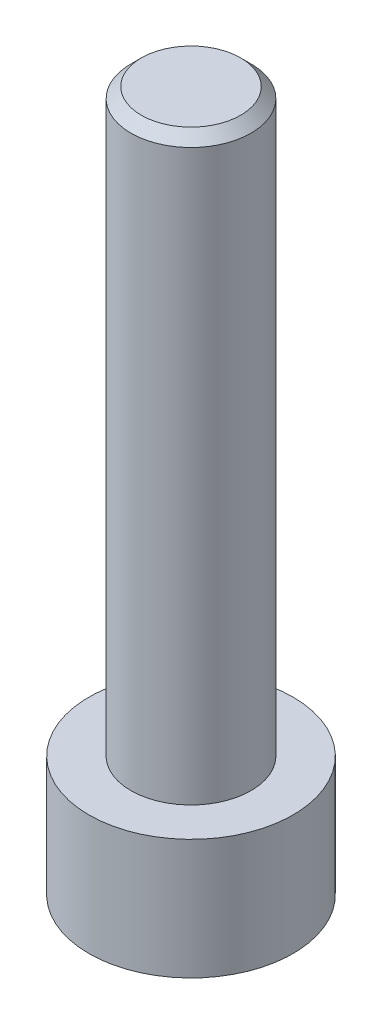
ISO-10303-21;
HEADER;
FILE_DESCRIPTION(('STEP AP214'),'2;1');
FILE_NAME('part.step','',(''),(''),'','','');
FILE_SCHEMA(('AUTOMOTIVE_DESIGN { 1 0 10303 214 1 1 1 1 }'));
ENDSEC;
DATA;
#1=APPLICATION_CONTEXT('core data for automotive mechanical design processes');
#2=APPLICATION_PROTOCOL_DEFINITION('international standard','automotive_design',2000,#1);
#3=PRODUCT_CONTEXT('',#1,'mechanical');
#4=PRODUCT('Part','Part','',(#3));
#5=PRODUCT_RELATED_PRODUCT_CATEGORY('part','',(#4));
#6=PRODUCT_DEFINITION_FORMATION('','',#4);
#7=PRODUCT_DEFINITION_CONTEXT('part definition',#1,'design');
#8=PRODUCT_DEFINITION('design','',#6,#7);
#9=PRODUCT_DEFINITION_SHAPE('','',#8);
#10=(LENGTH_UNIT() NAMED_UNIT(*) SI_UNIT(.MILLI.,.METRE.));
#11=(NAMED_UNIT(*) PLANE_ANGLE_UNIT() SI_UNIT($,.RADIAN.));
#12=(NAMED_UNIT(*) SI_UNIT($,.STERADIAN.) SOLID_ANGLE_UNIT());
#13=UNCERTAINTY_MEASURE_WITH_UNIT(LENGTH_MEASURE(1.E-05),#10,'distance_accuracy_value','');
#14=(GEOMETRIC_REPRESENTATION_CONTEXT(3) GLOBAL_UNCERTAINTY_ASSIGNED_CONTEXT((#13)) GLOBAL_UNIT_ASSIGNED_CONTEXT((#10,
#11,#12)) REPRESENTATION_CONTEXT('',''));
#15=CARTESIAN_POINT('',(0.,0.,0.));
#16=DIRECTION('',(0.,0.,1.));
#17=DIRECTION('',(1.,0.,0.));
#18=AXIS2_PLACEMENT_3D('',#15,#16,#17);
#19=CARTESIAN_POINT('',(0.,2.9,0.));
#20=DIRECTION('',(0.,-1.,0.));
#21=DIRECTION('',(0.,0.,-1.));
#22=AXIS2_PLACEMENT_3D('',#19,#20,#21);
#23=CYLINDRICAL_SURFACE('',#22,2.465);
#24=CARTESIAN_POINT('',(0.,2.9,0.));
#25=DIRECTION('',(0.,1.,0.));
#26=DIRECTION('',(0.,0.,1.));
#27=AXIS2_PLACEMENT_3D('',#24,#25,#26);
#28=CIRCLE('',#27,2.465);
#29=CARTESIAN_POINT('',(0.,2.9,2.465));
#30=VERTEX_POINT('',#29);
#31=EDGE_CURVE('E177',#30,#30,#28,.T.);
#32=ORIENTED_EDGE('',*,*,#31,.F.);
#33=EDGE_LOOP('',(#32));
#34=FACE_BOUND('',#33,.T.);
#35=CARTESIAN_POINT('',(0.,0.,0.));
#36=DIRECTION('',(0.,1.,0.));
#37=DIRECTION('',(0.,0.,1.));
#38=AXIS2_PLACEMENT_3D('',#35,#36,#37);
#39=CIRCLE('',#38,2.465);
#40=CARTESIAN_POINT('',(0.,0.,2.465));
#41=VERTEX_POINT('',#40);
#42=EDGE_CURVE('E163',#41,#41,#39,.T.);
#43=ORIENTED_EDGE('',*,*,#42,.T.);
#44=EDGE_LOOP('',(#43));
#45=FACE_BOUND('',#44,.T.);
#46=ADVANCED_FACE('F47',(#34,#45),#23,.T.);
#47=CARTESIAN_POINT('',(0.,2.9,0.));
#48=DIRECTION('',(0.,1.,0.));
#49=DIRECTION('',(0.,0.,1.));
#50=AXIS2_PLACEMENT_3D('',#47,#48,#49);
#51=PLANE('',#50);
#52=CARTESIAN_POINT('',(0.,2.9,0.));
#53=DIRECTION('',(0.,1.,0.));
#54=DIRECTION('',(0.,0.,1.));
#55=AXIS2_PLACEMENT_3D('',#52,#53,#54);
#56=CIRCLE('',#55,1.45);
#57=CARTESIAN_POINT('',(0.,2.9,1.45));
#58=VERTEX_POINT('',#57);
#59=EDGE_CURVE('E173',#58,#58,#56,.T.);
#60=ORIENTED_EDGE('',*,*,#59,.F.);
#61=EDGE_LOOP('',(#60));
#62=FACE_BOUND('',#61,.T.);
#63=ORIENTED_EDGE('',*,*,#31,.T.);
#64=EDGE_LOOP('',(#63));
#65=FACE_BOUND('',#64,.T.);
#66=ADVANCED_FACE('F199',(#62,#65),#51,.T.);
#67=CARTESIAN_POINT('',(0.,0.,0.));
#68=DIRECTION('',(0.,1.,0.));
#69=DIRECTION('',(0.,0.,1.));
#70=AXIS2_PLACEMENT_3D('',#67,#68,#69);
#71=PLANE('',#70);
#72=DIRECTION('',(0.5,0.,0.866025403784439));
#73=VECTOR('',#72,1.);
#74=CARTESIAN_POINT('',(0.733234841870825,0.,-1.27));
#75=LINE('',#74,#73);
#76=CARTESIAN_POINT('',(0.733234841870825,0.,-1.27));
#77=VERTEX_POINT('',#76);
#78=CARTESIAN_POINT('',(1.46646968374165,0.,0.));
#79=VERTEX_POINT('',#78);
#80=EDGE_CURVE('E144',#77,#79,#75,.T.);
#81=ORIENTED_EDGE('',*,*,#80,.F.);
#82=DIRECTION('',(1.,0.,0.));
#83=VECTOR('',#82,1.);
#84=CARTESIAN_POINT('',(-0.733234841870825,0.,-1.27));
#85=LINE('',#84,#83);
#86=CARTESIAN_POINT('',(-0.733234841870825,0.,-1.27));
#87=VERTEX_POINT('',#86);
#88=EDGE_CURVE('E64',#87,#77,#85,.T.);
#89=ORIENTED_EDGE('',*,*,#88,.F.);
#90=DIRECTION('',(0.5,0.,-0.866025403784438));
#91=VECTOR('',#90,1.);
#92=CARTESIAN_POINT('',(-1.46646968374165,0.,0.));
#93=LINE('',#92,#91);
#94=CARTESIAN_POINT('',(-1.46646968374165,0.,0.));
#95=VERTEX_POINT('',#94);
#96=EDGE_CURVE('E157',#95,#87,#93,.T.);
#97=ORIENTED_EDGE('',*,*,#96,.F.);
#98=DIRECTION('',(-0.5,0.,-0.866025403784439));
#99=VECTOR('',#98,1.);
#100=CARTESIAN_POINT('',(-0.733234841870825,0.,1.27));
#101=LINE('',#100,#99);
#102=CARTESIAN_POINT('',(-0.733234841870825,0.,1.27));
#103=VERTEX_POINT('',#102);
#104=EDGE_CURVE('E154',#103,#95,#101,.T.);
#105=ORIENTED_EDGE('',*,*,#104,.F.);
#106=DIRECTION('',(-1.,0.,0.));
#107=VECTOR('',#106,1.);
#108=CARTESIAN_POINT('',(0.733234841870825,0.,1.27));
#109=LINE('',#108,#107);
#110=CARTESIAN_POINT('',(0.733234841870825,0.,1.27));
#111=VERTEX_POINT('',#110);
#112=EDGE_CURVE('E112',#111,#103,#109,.T.);
#113=ORIENTED_EDGE('',*,*,#112,.F.);
#114=DIRECTION('',(-0.5,0.,0.866025403784439));
#115=VECTOR('',#114,1.);
#116=CARTESIAN_POINT('',(1.46646968374165,0.,0.));
#117=LINE('',#116,#115);
#118=EDGE_CURVE('E148',#79,#111,#117,.T.);
#119=ORIENTED_EDGE('',*,*,#118,.F.);
#120=EDGE_LOOP('',(#81,#89,#97,#105,#113,#119));
#121=FACE_BOUND('',#120,.T.);
#122=ORIENTED_EDGE('',*,*,#42,.F.);
#123=EDGE_LOOP('',(#122));
#124=FACE_BOUND('',#123,.T.);
#125=ADVANCED_FACE('F204',(#121,#124),#71,.F.);
#126=CARTESIAN_POINT('',(0.,16.9,0.));
#127=DIRECTION('',(0.,-1.,0.));
#128=DIRECTION('',(0.,0.,-1.));
#129=AXIS2_PLACEMENT_3D('',#126,#127,#128);
#130=CYLINDRICAL_SURFACE('',#129,1.45);
#131=CARTESIAN_POINT('',(0.,16.65,0.));
#132=DIRECTION('',(0.,1.,0.));
#133=DIRECTION('',(0.,0.,1.));
#134=AXIS2_PLACEMENT_3D('',#131,#132,#133);
#135=CIRCLE('',#134,1.45);
#136=CARTESIAN_POINT('',(0.,16.65,1.45));
#137=VERTEX_POINT('',#136);
#138=EDGE_CURVE('E11',#137,#137,#135,.F.);
#139=ORIENTED_EDGE('',*,*,#138,.T.);
#140=EDGE_LOOP('',(#139));
#141=FACE_BOUND('',#140,.T.);
#142=ORIENTED_EDGE('',*,*,#59,.T.);
#143=EDGE_LOOP('',(#142));
#144=FACE_BOUND('',#143,.T.);
#145=ADVANCED_FACE('F211',(#141,#144),#130,.T.);
#146=CARTESIAN_POINT('',(0.,16.9,0.));
#147=DIRECTION('',(0.,1.,0.));
#148=DIRECTION('',(0.,0.,1.));
#149=AXIS2_PLACEMENT_3D('',#146,#147,#148);
#150=PLANE('',#149);
#151=CARTESIAN_POINT('',(0.,16.9,0.));
#152=DIRECTION('',(0.,1.,0.));
#153=DIRECTION('',(0.,0.,1.));
#154=AXIS2_PLACEMENT_3D('',#151,#152,#153);
#155=CIRCLE('',#154,1.2);
#156=CARTESIAN_POINT('',(0.,16.9,1.2));
#157=VERTEX_POINT('',#156);
#158=EDGE_CURVE('E57',#157,#157,#155,.T.);
#159=ORIENTED_EDGE('',*,*,#158,.T.);
#160=EDGE_LOOP('',(#159));
#161=FACE_BOUND('',#160,.T.);
#162=ADVANCED_FACE('F187',(#161),#150,.T.);
#163=CARTESIAN_POINT('',(-0.733234841870825,1.9,-1.27));
#164=DIRECTION('',(0.,0.,-1.));
#165=DIRECTION('',(-1.,0.,0.));
#166=AXIS2_PLACEMENT_3D('',#163,#164,#165);
#167=PLANE('',#166);
#168=ORIENTED_EDGE('',*,*,#88,.T.);
#169=DIRECTION('',(0.,-1.,0.));
#170=VECTOR('',#169,1.);
#171=CARTESIAN_POINT('',(0.733234841870825,1.9,-1.27));
#172=LINE('',#171,#170);
#173=CARTESIAN_POINT('',(0.733234841870825,1.9,-1.27));
#174=VERTEX_POINT('',#173);
#175=EDGE_CURVE('E94',#174,#77,#172,.T.);
#176=ORIENTED_EDGE('',*,*,#175,.F.);
#177=DIRECTION('',(1.,0.,0.));
#178=VECTOR('',#177,1.);
#179=CARTESIAN_POINT('',(-0.733234841870825,1.9,-1.27));
#180=LINE('',#179,#178);
#181=CARTESIAN_POINT('',(-0.733234841870825,1.9,-1.27));
#182=VERTEX_POINT('',#181);
#183=EDGE_CURVE('E160',#182,#174,#180,.T.);
#184=ORIENTED_EDGE('',*,*,#183,.F.);
#185=DIRECTION('',(0.,-1.,0.));
#186=VECTOR('',#185,1.);
#187=CARTESIAN_POINT('',(-0.733234841870825,1.9,-1.27));
#188=LINE('',#187,#186);
#189=EDGE_CURVE('E72',#182,#87,#188,.T.);
#190=ORIENTED_EDGE('',*,*,#189,.T.);
#191=EDGE_LOOP('',(#168,#176,#184,#190));
#192=FACE_BOUND('',#191,.T.);
#193=ADVANCED_FACE('F218',(#192),#167,.F.);
#194=CARTESIAN_POINT('',(-1.46646968374165,1.9,0.));
#195=DIRECTION('',(-0.866025403784439,0.,-0.5));
#196=DIRECTION('',(-0.5,0.,0.866025403784439));
#197=AXIS2_PLACEMENT_3D('',#194,#195,#196);
#198=PLANE('',#197);
#199=ORIENTED_EDGE('',*,*,#96,.T.);
#200=ORIENTED_EDGE('',*,*,#189,.F.);
#201=DIRECTION('',(0.5,0.,-0.866025403784438));
#202=VECTOR('',#201,1.);
#203=CARTESIAN_POINT('',(-1.46646968374165,1.9,0.));
#204=LINE('',#203,#202);
#205=CARTESIAN_POINT('',(-1.46646968374165,1.9,0.));
#206=VERTEX_POINT('',#205);
#207=EDGE_CURVE('E126',#206,#182,#204,.T.);
#208=ORIENTED_EDGE('',*,*,#207,.F.);
#209=DIRECTION('',(0.,-1.,0.));
#210=VECTOR('',#209,1.);
#211=CARTESIAN_POINT('',(-1.46646968374165,1.9,0.));
#212=LINE('',#211,#210);
#213=EDGE_CURVE('E117',#206,#95,#212,.T.);
#214=ORIENTED_EDGE('',*,*,#213,.T.);
#215=EDGE_LOOP('',(#199,#200,#208,#214));
#216=FACE_BOUND('',#215,.T.);
#217=ADVANCED_FACE('F221',(#216),#198,.F.);
#218=CARTESIAN_POINT('',(-0.733234841870825,1.9,1.27));
#219=DIRECTION('',(-0.866025403784438,0.,0.5));
#220=DIRECTION('',(0.5,0.,0.866025403784439));
#221=AXIS2_PLACEMENT_3D('',#218,#219,#220);
#222=PLANE('',#221);
#223=ORIENTED_EDGE('',*,*,#104,.T.);
#224=ORIENTED_EDGE('',*,*,#213,.F.);
#225=DIRECTION('',(-0.5,0.,-0.866025403784439));
#226=VECTOR('',#225,1.);
#227=CARTESIAN_POINT('',(-0.733234841870825,1.9,1.27));
#228=LINE('',#227,#226);
#229=CARTESIAN_POINT('',(-0.733234841870825,1.9,1.27));
#230=VERTEX_POINT('',#229);
#231=EDGE_CURVE('E121',#230,#206,#228,.T.);
#232=ORIENTED_EDGE('',*,*,#231,.F.);
#233=DIRECTION('',(0.,-1.,0.));
#234=VECTOR('',#233,1.);
#235=CARTESIAN_POINT('',(-0.733234841870825,1.9,1.27));
#236=LINE('',#235,#234);
#237=EDGE_CURVE('E105',#230,#103,#236,.T.);
#238=ORIENTED_EDGE('',*,*,#237,.T.);
#239=EDGE_LOOP('',(#223,#224,#232,#238));
#240=FACE_BOUND('',#239,.T.);
#241=ADVANCED_FACE('F122',(#240),#222,.F.);
#242=CARTESIAN_POINT('',(0.733234841870825,1.9,1.27));
#243=DIRECTION('',(0.,0.,1.));
#244=DIRECTION('',(1.,0.,0.));
#245=AXIS2_PLACEMENT_3D('',#242,#243,#244);
#246=PLANE('',#245);
#247=ORIENTED_EDGE('',*,*,#112,.T.);
#248=ORIENTED_EDGE('',*,*,#237,.F.);
#249=DIRECTION('',(-1.,0.,0.));
#250=VECTOR('',#249,1.);
#251=CARTESIAN_POINT('',(0.733234841870825,1.9,1.27));
#252=LINE('',#251,#250);
#253=CARTESIAN_POINT('',(0.733234841870825,1.9,1.27));
#254=VERTEX_POINT('',#253);
#255=EDGE_CURVE('E109',#254,#230,#252,.T.);
#256=ORIENTED_EDGE('',*,*,#255,.F.);
#257=DIRECTION('',(0.,-1.,0.));
#258=VECTOR('',#257,1.);
#259=CARTESIAN_POINT('',(0.733234841870825,1.9,1.27));
#260=LINE('',#259,#258);
#261=EDGE_CURVE('E118',#254,#111,#260,.T.);
#262=ORIENTED_EDGE('',*,*,#261,.T.);
#263=EDGE_LOOP('',(#247,#248,#256,#262));
#264=FACE_BOUND('',#263,.T.);
#265=ADVANCED_FACE('F107',(#264),#246,.F.);
#266=CARTESIAN_POINT('',(1.46646968374165,1.9,0.));
#267=DIRECTION('',(0.866025403784438,0.,0.5));
#268=DIRECTION('',(0.5,0.,-0.866025403784439));
#269=AXIS2_PLACEMENT_3D('',#266,#267,#268);
#270=PLANE('',#269);
#271=ORIENTED_EDGE('',*,*,#118,.T.);
#272=ORIENTED_EDGE('',*,*,#261,.F.);
#273=DIRECTION('',(-0.5,0.,0.866025403784439));
#274=VECTOR('',#273,1.);
#275=CARTESIAN_POINT('',(1.46646968374165,1.9,0.));
#276=LINE('',#275,#274);
#277=CARTESIAN_POINT('',(1.46646968374165,1.9,0.));
#278=VERTEX_POINT('',#277);
#279=EDGE_CURVE('E132',#278,#254,#276,.T.);
#280=ORIENTED_EDGE('',*,*,#279,.F.);
#281=DIRECTION('',(0.,-1.,0.));
#282=VECTOR('',#281,1.);
#283=CARTESIAN_POINT('',(1.46646968374165,1.9,0.));
#284=LINE('',#283,#282);
#285=EDGE_CURVE('E168',#278,#79,#284,.T.);
#286=ORIENTED_EDGE('',*,*,#285,.T.);
#287=EDGE_LOOP('',(#271,#272,#280,#286));
#288=FACE_BOUND('',#287,.T.);
#289=ADVANCED_FACE('F224',(#288),#270,.F.);
#290=CARTESIAN_POINT('',(0.733234841870825,1.9,-1.27));
#291=DIRECTION('',(0.866025403784438,0.,-0.5));
#292=DIRECTION('',(-0.5,0.,-0.866025403784439));
#293=AXIS2_PLACEMENT_3D('',#290,#291,#292);
#294=PLANE('',#293);
#295=ORIENTED_EDGE('',*,*,#80,.T.);
#296=ORIENTED_EDGE('',*,*,#285,.F.);
#297=DIRECTION('',(0.5,0.,0.866025403784439));
#298=VECTOR('',#297,1.);
#299=CARTESIAN_POINT('',(0.733234841870825,1.9,-1.27));
#300=LINE('',#299,#298);
#301=EDGE_CURVE('E136',#174,#278,#300,.T.);
#302=ORIENTED_EDGE('',*,*,#301,.F.);
#303=ORIENTED_EDGE('',*,*,#175,.T.);
#304=EDGE_LOOP('',(#295,#296,#302,#303));
#305=FACE_BOUND('',#304,.T.);
#306=ADVANCED_FACE('F195',(#305),#294,.F.);
#307=CARTESIAN_POINT('',(0.,1.9,0.));
#308=DIRECTION('',(0.,-1.,0.));
#309=DIRECTION('',(0.,0.,-1.));
#310=AXIS2_PLACEMENT_3D('',#307,#308,#309);
#311=PLANE('',#310);
#312=ORIENTED_EDGE('',*,*,#183,.T.);
#313=ORIENTED_EDGE('',*,*,#301,.T.);
#314=ORIENTED_EDGE('',*,*,#279,.T.);
#315=ORIENTED_EDGE('',*,*,#255,.T.);
#316=ORIENTED_EDGE('',*,*,#231,.T.);
#317=ORIENTED_EDGE('',*,*,#207,.T.);
#318=EDGE_LOOP('',(#312,#313,#314,#315,#316,#317));
#319=FACE_BOUND('',#318,.T.);
#320=ADVANCED_FACE('F129',(#319),#311,.T.);
#321=CARTESIAN_POINT('',(0.,16.9,0.));
#322=DIRECTION('',(0.,-1.,0.));
#323=DIRECTION('',(0.,0.,-1.));
#324=AXIS2_PLACEMENT_3D('',#321,#322,#323);
#325=CONICAL_SURFACE('',#324,1.2,0.785398163397452);
#326=ORIENTED_EDGE('',*,*,#138,.F.);
#327=EDGE_LOOP('',(#326));
#328=FACE_BOUND('',#327,.T.);
#329=ORIENTED_EDGE('',*,*,#158,.F.);
#330=EDGE_LOOP('',(#329));
#331=FACE_BOUND('',#330,.T.);
#332=ADVANCED_FACE('F50',(#328,#331),#325,.T.);
#333=CLOSED_SHELL('',(#46,#66,#125,#145,#162,#193,#217,#241,#265,#289,#306,#320,#332));
#334=MANIFOLD_SOLID_BREP('B2',#333);
#335=ADVANCED_BREP_SHAPE_REPRESENTATION('',(#18,#334),#14);
#336=SHAPE_DEFINITION_REPRESENTATION(#9,#335);
ENDSEC;
END-ISO-10303-21;
